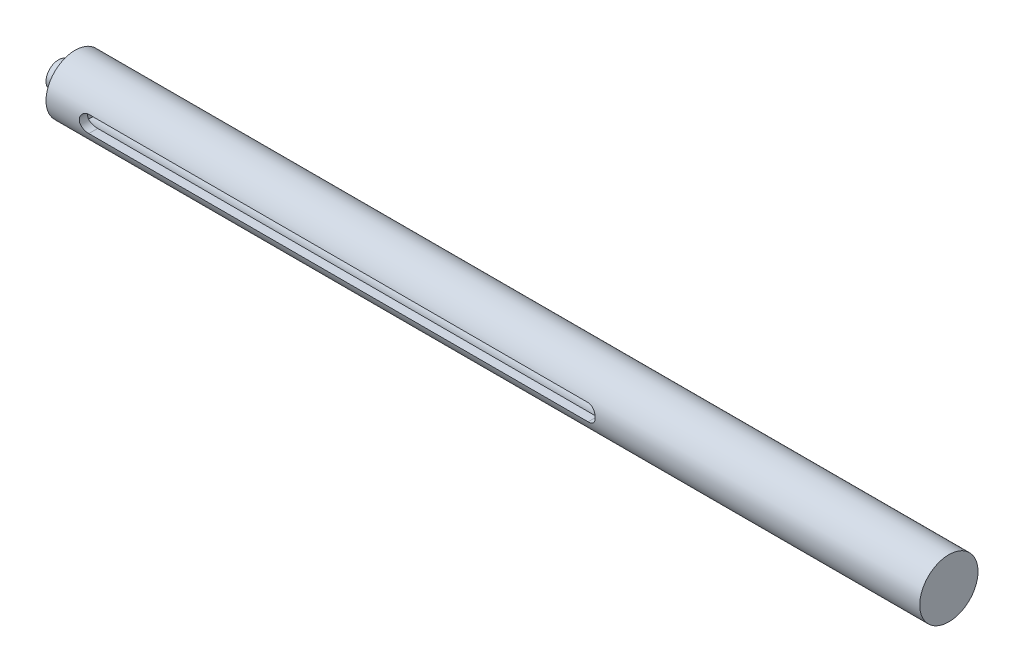
ISO-10303-21;
HEADER;
FILE_DESCRIPTION(('STEP AP214'),'2;1');
FILE_NAME('part.step','',(''),(''),'','','');
FILE_SCHEMA(('AUTOMOTIVE_DESIGN { 1 0 10303 214 1 1 1 1 }'));
ENDSEC;
DATA;
#1=APPLICATION_CONTEXT('core data for automotive mechanical design processes');
#2=APPLICATION_PROTOCOL_DEFINITION('international standard','automotive_design',2000,#1);
#3=PRODUCT_CONTEXT('',#1,'mechanical');
#4=PRODUCT('Part','Part','',(#3));
#5=PRODUCT_RELATED_PRODUCT_CATEGORY('part','',(#4));
#6=PRODUCT_DEFINITION_FORMATION('','',#4);
#7=PRODUCT_DEFINITION_CONTEXT('part definition',#1,'design');
#8=PRODUCT_DEFINITION('design','',#6,#7);
#9=PRODUCT_DEFINITION_SHAPE('','',#8);
#10=(LENGTH_UNIT() NAMED_UNIT(*) SI_UNIT(.MILLI.,.METRE.));
#11=(NAMED_UNIT(*) PLANE_ANGLE_UNIT() SI_UNIT($,.RADIAN.));
#12=(NAMED_UNIT(*) SI_UNIT($,.STERADIAN.) SOLID_ANGLE_UNIT());
#13=UNCERTAINTY_MEASURE_WITH_UNIT(LENGTH_MEASURE(1.E-05),#10,'distance_accuracy_value','');
#14=(GEOMETRIC_REPRESENTATION_CONTEXT(3) GLOBAL_UNCERTAINTY_ASSIGNED_CONTEXT((#13)) GLOBAL_UNIT_ASSIGNED_CONTEXT((#10,
#11,#12)) REPRESENTATION_CONTEXT('',''));
#15=CARTESIAN_POINT('',(0.,0.,0.));
#16=DIRECTION('',(0.,0.,1.));
#17=DIRECTION('',(1.,0.,0.));
#18=AXIS2_PLACEMENT_3D('',#15,#16,#17);
#19=CARTESIAN_POINT('',(-40.,0.,0.));
#20=DIRECTION('',(1.,0.,0.));
#21=DIRECTION('',(0.,0.,-1.));
#22=AXIS2_PLACEMENT_3D('',#19,#20,#21);
#23=PLANE('',#22);
#24=CARTESIAN_POINT('',(-40.,0.,0.));
#25=DIRECTION('',(1.,0.,0.));
#26=DIRECTION('',(0.,0.,-1.));
#27=AXIS2_PLACEMENT_3D('',#24,#25,#26);
#28=CIRCLE('',#27,3.5);
#29=CARTESIAN_POINT('',(-40.,0.,-3.5));
#30=VERTEX_POINT('',#29);
#31=EDGE_CURVE('E95',#30,#30,#28,.T.);
#32=ORIENTED_EDGE('',*,*,#31,.F.);
#33=EDGE_LOOP('',(#32));
#34=FACE_BOUND('',#33,.T.);
#35=CARTESIAN_POINT('',(-40.,0.,0.));
#36=DIRECTION('',(1.,0.,0.));
#37=DIRECTION('',(0.,0.,-1.));
#38=AXIS2_PLACEMENT_3D('',#35,#36,#37);
#39=CIRCLE('',#38,1.5);
#40=CARTESIAN_POINT('',(-40.,0.,-1.5));
#41=VERTEX_POINT('',#40);
#42=EDGE_CURVE('E35',#41,#41,#39,.F.);
#43=ORIENTED_EDGE('',*,*,#42,.F.);
#44=EDGE_LOOP('',(#43));
#45=FACE_BOUND('',#44,.T.);
#46=ADVANCED_FACE('F26',(#34,#45),#23,.F.);
#47=CARTESIAN_POINT('',(40.,0.,0.));
#48=DIRECTION('',(-1.,0.,0.));
#49=DIRECTION('',(0.,0.,1.));
#50=AXIS2_PLACEMENT_3D('',#47,#48,#49);
#51=CYLINDRICAL_SURFACE('',#50,3.5);
#52=ORIENTED_EDGE('',*,*,#31,.T.);
#53=EDGE_LOOP('',(#52));
#54=FACE_BOUND('',#53,.T.);
#55=CARTESIAN_POINT('',(25.,-1.,3.35410196624968));
#56=CARTESIAN_POINT('',(25.0275170249075,-1.00000049850503,3.35409976658492));
#57=CARTESIAN_POINT('',(25.0550202597348,-0.998863493287081,3.35444102034788));
#58=CARTESIAN_POINT('',(25.1098181033841,-0.994332009888001,3.35578786459359));
#59=CARTESIAN_POINT('',(25.1371127542802,-0.990937999820865,3.3567933173179));
#60=CARTESIAN_POINT('',(25.2182537496955,-0.977425314705552,3.36076375039943));
#61=CARTESIAN_POINT('',(25.2715378170372,-0.963975716618306,3.36468309657148));
#62=CARTESIAN_POINT('',(25.3749700144545,-0.928648815906224,3.37460265056326));
#63=CARTESIAN_POINT('',(25.4251189911293,-0.906773800005599,3.38060229373009));
#64=CARTESIAN_POINT('',(25.5210683200399,-0.855250482454159,3.39400252324997));
#65=CARTESIAN_POINT('',(25.5668668974157,-0.825599026596321,3.40140367773159));
#66=CARTESIAN_POINT('',(25.6540953815059,-0.758463189713919,3.41700871116802));
#67=CARTESIAN_POINT('',(25.6953820675198,-0.72079643428964,3.42522837538694));
#68=CARTESIAN_POINT('',(25.7711495263556,-0.639087782954267,3.44140944203543));
#69=CARTESIAN_POINT('',(25.8056291705064,-0.595044831905348,3.44937080145308));
#70=CARTESIAN_POINT('',(25.8674150706982,-0.500821950623903,3.46431682750159));
#71=CARTESIAN_POINT('',(25.8945760360545,-0.450543143150311,3.47128058280447));
#72=CARTESIAN_POINT('',(25.940001691248,-0.345901809951461,3.48326292773679));
#73=CARTESIAN_POINT('',(25.9582685086114,-0.291540264432993,3.48828198248995));
#74=CARTESIAN_POINT('',(25.9849170938375,-0.18177986422046,3.49569755735467));
#75=CARTESIAN_POINT('',(25.9935443291132,-0.126445076386653,3.49815908311015));
#76=CARTESIAN_POINT('',(26.0014433806286,-0.0150612429205636,3.50041048233729));
#77=CARTESIAN_POINT('',(26.0007167870587,0.0409876796872728,3.50020080992396));
#78=CARTESIAN_POINT('',(25.9900967865968,0.150490378802964,3.49718002611497));
#79=CARTESIAN_POINT('',(25.9804690968915,0.203972329131895,3.4944443251868));
#80=CARTESIAN_POINT('',(25.9527522573653,0.308526642102498,3.48676938053403));
#81=CARTESIAN_POINT('',(25.9346626803645,0.359598882951953,3.48183002556336));
#82=CARTESIAN_POINT('',(25.8903451327296,0.458537318553558,3.47019511125505));
#83=CARTESIAN_POINT('',(25.8640302352287,0.506362294335579,3.46348091788377));
#84=CARTESIAN_POINT('',(25.8040771088532,0.597004321590961,3.44901371958343));
#85=CARTESIAN_POINT('',(25.770437393581,0.639820353903323,3.44126050393247));
#86=CARTESIAN_POINT('',(25.695401201975,0.720812145758809,3.42522923719649));
#87=CARTESIAN_POINT('',(25.6537744565459,0.758773058684968,3.41694231453104));
#88=CARTESIAN_POINT('',(25.5646513518634,0.827240355260741,3.40101643089073));
#89=CARTESIAN_POINT('',(25.5171533336562,0.857744624720446,3.39337765408524));
#90=CARTESIAN_POINT('',(25.4171063869067,0.910632887034017,3.37957156162494));
#91=CARTESIAN_POINT('',(25.3645179481512,0.932945634858352,3.37341730876614));
#92=CARTESIAN_POINT('',(25.2561439679439,0.968311532076212,3.36343812734786));
#93=CARTESIAN_POINT('',(25.2003634116952,0.981378715751668,3.3596096696078));
#94=CARTESIAN_POINT('',(25.1200602690921,0.993060108315531,3.35616467475823));
#95=CARTESIAN_POINT('',(25.0961103225751,0.995662513879,3.35539270208153));
#96=CARTESIAN_POINT('',(25.0481108873562,0.999130770524189,3.35436137521794));
#97=CARTESIAN_POINT('',(25.0240616067922,0.999999270178643,3.35410123920007));
#98=CARTESIAN_POINT('',(25.,1.,3.35410196624968));
#99=B_SPLINE_CURVE_WITH_KNOTS('',3,(#55,#56,#57,#58,#59,#60,#61,#62,#63,#64,#65,#66,#67,#68,#69,
#70,#71,#72,#73,#74,#75,#76,#77,#78,#79,#80,#81,#82,#83,#84,#85,#86,#87,#88,#89,#90,#91,#92,#93,
#94,#95,#96,#97,#98),.UNSPECIFIED.,.F.,.F.,(4,2,2,2,2,2,2,2,2,2,2,2,2,2,2,2,2,2,2,2,2,4),(0.,
0.0824984357609059,0.164979766271595,0.329407523681618,0.493790685524924,0.658240626330376,
0.826933952896786,0.995655226942842,1.16751346138032,1.33933056621707,1.50666495361948,
1.67397089384628,1.83643825095359,1.99891381075498,2.16316806750177,2.32745568686297,
2.49749310251654,2.6675786732818,2.83911034045408,3.01038106966817,3.08263487199162,
3.15477822061624),.UNSPECIFIED.);
#100=CARTESIAN_POINT('',(25.,-1.,3.35410196624968));
#101=VERTEX_POINT('',#100);
#102=CARTESIAN_POINT('',(25.,1.,3.35410196624968));
#103=VERTEX_POINT('',#102);
#104=EDGE_CURVE('E98',#101,#103,#99,.T.);
#105=ORIENTED_EDGE('',*,*,#104,.F.);
#106=DIRECTION('',(-1.,0.,0.));
#107=VECTOR('',#106,1.);
#108=CARTESIAN_POINT('',(40.,-1.,3.35410196624968));
#109=LINE('',#108,#107);
#110=CARTESIAN_POINT('',(-35.,-1.,3.35410196624968));
#111=VERTEX_POINT('',#110);
#112=EDGE_CURVE('E160',#111,#101,#109,.F.);
#113=ORIENTED_EDGE('',*,*,#112,.F.);
#114=CARTESIAN_POINT('',(-35.,1.,3.35410196624968));
#115=CARTESIAN_POINT('',(-35.0275170249075,1.00000049850503,3.35409976658492));
#116=CARTESIAN_POINT('',(-35.0550202597348,0.998863493287082,3.35444102034788));
#117=CARTESIAN_POINT('',(-35.1098181033841,0.994332009888001,3.35578786459359));
#118=CARTESIAN_POINT('',(-35.1371127542802,0.990937999820865,3.3567933173179));
#119=CARTESIAN_POINT('',(-35.2182537496955,0.977425314705554,3.36076375039943));
#120=CARTESIAN_POINT('',(-35.2715378170372,0.963975716618308,3.36468309657148));
#121=CARTESIAN_POINT('',(-35.3749700144545,0.928648815906219,3.37460265056326));
#122=CARTESIAN_POINT('',(-35.4251189911293,0.906773800005585,3.38060229373009));
#123=CARTESIAN_POINT('',(-35.52106832004,0.855250482454147,3.39400252324997));
#124=CARTESIAN_POINT('',(-35.5668668974158,0.825599026596321,3.40140367773159));
#125=CARTESIAN_POINT('',(-35.6540953815059,0.75846318971392,3.41700871116802));
#126=CARTESIAN_POINT('',(-35.6953820675198,0.720796434289633,3.42522837538694));
#127=CARTESIAN_POINT('',(-35.7711495263556,0.639087782954258,3.44140944203543));
#128=CARTESIAN_POINT('',(-35.8056291705064,0.595044831905346,3.44937080145308));
#129=CARTESIAN_POINT('',(-35.8674150706982,0.500821950623907,3.46431682750159));
#130=CARTESIAN_POINT('',(-35.8945760360545,0.450543143150314,3.47128058280446));
#131=CARTESIAN_POINT('',(-35.940001691248,0.345901809951462,3.48326292773679));
#132=CARTESIAN_POINT('',(-35.9582685086114,0.291540264432993,3.48828198248995));
#133=CARTESIAN_POINT('',(-35.9849170938375,0.181779864220459,3.49569755735467));
#134=CARTESIAN_POINT('',(-35.9935443291132,0.126445076386652,3.49815908311015));
#135=CARTESIAN_POINT('',(-36.0014433806286,0.0150612429205627,3.50041048233729));
#136=CARTESIAN_POINT('',(-36.0007167870587,-0.0409876796872739,3.50020080992396));
#137=CARTESIAN_POINT('',(-35.9900967865968,-0.150490378802965,3.49718002611497));
#138=CARTESIAN_POINT('',(-35.9804690968915,-0.203972329131895,3.4944443251868));
#139=CARTESIAN_POINT('',(-35.9527522573653,-0.308526642102499,3.48676938053403));
#140=CARTESIAN_POINT('',(-35.9346626803645,-0.359598882951955,3.48183002556336));
#141=CARTESIAN_POINT('',(-35.8903451327296,-0.458537318553552,3.47019511125505));
#142=CARTESIAN_POINT('',(-35.8640302352286,-0.506362294335566,3.46348091788377));
#143=CARTESIAN_POINT('',(-35.8040771088533,-0.597004321590951,3.44901371958344));
#144=CARTESIAN_POINT('',(-35.7704373935811,-0.639820353903326,3.44126050393247));
#145=CARTESIAN_POINT('',(-35.695401201975,-0.720812145758812,3.42522923719649));
#146=CARTESIAN_POINT('',(-35.6537744565459,-0.758773058684957,3.41694231453104));
#147=CARTESIAN_POINT('',(-35.5646513518634,-0.827240355260727,3.40101643089074));
#148=CARTESIAN_POINT('',(-35.5171533336562,-0.857744624720442,3.39337765408524));
#149=CARTESIAN_POINT('',(-35.4171063869067,-0.910632887034021,3.37957156162494));
#150=CARTESIAN_POINT('',(-35.3645179481512,-0.932945634858353,3.37341730876614));
#151=CARTESIAN_POINT('',(-35.2561439679439,-0.968311532076213,3.36343812734786));
#152=CARTESIAN_POINT('',(-35.2003634116952,-0.981378715751669,3.3596096696078));
#153=CARTESIAN_POINT('',(-35.1200602690921,-0.993060108315532,3.35616467475823));
#154=CARTESIAN_POINT('',(-35.0961103225751,-0.995662513879001,3.35539270208153));
#155=CARTESIAN_POINT('',(-35.0481108873562,-0.999130770524188,3.35436137521794));
#156=CARTESIAN_POINT('',(-35.0240616067922,-0.999999270178643,3.35410123920007));
#157=CARTESIAN_POINT('',(-35.,-1.,3.35410196624968));
#158=B_SPLINE_CURVE_WITH_KNOTS('',3,(#114,#115,#116,#117,#118,#119,#120,#121,#122,#123,#124,
#125,#126,#127,#128,#129,#130,#131,#132,#133,#134,#135,#136,#137,#138,#139,#140,#141,#142,#143,
#144,#145,#146,#147,#148,#149,#150,#151,#152,#153,#154,#155,#156,#157),.UNSPECIFIED.,.F.,.F.,(4,
2,2,2,2,2,2,2,2,2,2,2,2,2,2,2,2,2,2,2,2,4),(0.,0.0824984357609093,0.164979766271588,
0.329407523681618,0.493790685524952,0.658240626330415,0.826933952896799,0.99565522694284,
1.16751346138032,1.33933056621707,1.50666495361948,1.67397089384628,1.8364382509536,
1.99891381075499,2.16316806750176,2.32745568686294,2.49749310251653,2.66757867328181,
2.83911034045409,3.01038106966818,3.08263487199164,3.15477822061625),.UNSPECIFIED.);
#159=CARTESIAN_POINT('',(-35.,1.,3.35410196624968));
#160=VERTEX_POINT('',#159);
#161=EDGE_CURVE('E105',#160,#111,#158,.T.);
#162=ORIENTED_EDGE('',*,*,#161,.F.);
#163=DIRECTION('',(-1.,0.,0.));
#164=VECTOR('',#163,1.);
#165=CARTESIAN_POINT('',(40.,1.,3.35410196624968));
#166=LINE('',#165,#164);
#167=EDGE_CURVE('E83',#103,#160,#166,.T.);
#168=ORIENTED_EDGE('',*,*,#167,.F.);
#169=EDGE_LOOP('',(#105,#113,#162,#168));
#170=FACE_BOUND('',#169,.T.);
#171=CARTESIAN_POINT('',(65.,0.,0.));
#172=DIRECTION('',(1.,0.,0.));
#173=DIRECTION('',(0.,0.,-1.));
#174=AXIS2_PLACEMENT_3D('',#171,#172,#173);
#175=CIRCLE('',#174,3.5);
#176=CARTESIAN_POINT('',(65.,0.,-3.5));
#177=VERTEX_POINT('',#176);
#178=EDGE_CURVE('E78',#177,#177,#175,.T.);
#179=ORIENTED_EDGE('',*,*,#178,.F.);
#180=EDGE_LOOP('',(#179));
#181=FACE_BOUND('',#180,.T.);
#182=ADVANCED_FACE('F28',(#54,#170,#181),#51,.T.);
#183=CARTESIAN_POINT('',(-35.,0.,3.5));
#184=DIRECTION('',(0.,0.,-1.));
#185=DIRECTION('',(-1.,0.,0.));
#186=AXIS2_PLACEMENT_3D('',#183,#184,#185);
#187=CYLINDRICAL_SURFACE('',#186,1.);
#188=CARTESIAN_POINT('',(-35.,1.,2.29128784747792));
#189=CARTESIAN_POINT('',(-35.0269103840027,1.00000116386643,2.29128430939571));
#190=CARTESIAN_POINT('',(-35.0538065609444,0.998913043941582,2.29176252371932));
#191=CARTESIAN_POINT('',(-35.1073819223814,0.994580942217761,2.29364713413326));
#192=CARTESIAN_POINT('',(-35.1340611856053,0.991337781507211,2.29505317671192));
#193=CARTESIAN_POINT('',(-35.2132675610055,0.978449878798021,2.30059288924686));
#194=CARTESIAN_POINT('',(-35.2652248346111,0.965646201662909,2.30604882507105));
#195=CARTESIAN_POINT('',(-35.3660084567948,0.932127367996509,2.31979763689074));
#196=CARTESIAN_POINT('',(-35.4148379987117,0.91142043585267,2.32808756281048));
#197=CARTESIAN_POINT('',(-35.5083868962999,0.862742971325663,2.34656153650137));
#198=CARTESIAN_POINT('',(-35.5531022895601,0.834765533722777,2.35674738231355));
#199=CARTESIAN_POINT('',(-35.639634338551,0.770658598314694,2.37850508848236));
#200=CARTESIAN_POINT('',(-35.6811844510361,0.734184414240038,2.39012125272111));
#201=CARTESIAN_POINT('',(-35.7577692933566,0.654848386636597,2.41306392819471));
#202=CARTESIAN_POINT('',(-35.792802685594,0.611985234976875,2.42439037955359));
#203=CARTESIAN_POINT('',(-35.856703436018,0.519002909887977,2.44601709248996));
#204=CARTESIAN_POINT('',(-35.8852724685305,0.468663954715679,2.45625912457899));
#205=CARTESIAN_POINT('',(-35.9334219724715,0.363412083428239,2.47401971876446));
#206=CARTESIAN_POINT('',(-35.9530061953086,0.30850108760279,2.48153941723396));
#207=CARTESIAN_POINT('',(-35.9816706165632,0.19848371770778,2.49269157373246));
#208=CARTESIAN_POINT('',(-35.9912134797064,0.143515526475389,2.49649461286354));
#209=CARTESIAN_POINT('',(-36.0010142357207,0.0326342160141269,2.50040155088157));
#210=CARTESIAN_POINT('',(-36.001275417903,-0.0232785614371597,2.50050676023285));
#211=CARTESIAN_POINT('',(-35.9927585814665,-0.1311166883068,2.49710980025699));
#212=CARTESIAN_POINT('',(-35.9844874769435,-0.183089601305246,2.49380992793548));
#213=CARTESIAN_POINT('',(-35.9600032861927,-0.284837393198609,2.48424635219906));
#214=CARTESIAN_POINT('',(-35.94378975049,-0.334612147522428,2.47798248104744));
#215=CARTESIAN_POINT('',(-35.9036818518646,-0.431448769549348,2.46298415299617));
#216=CARTESIAN_POINT('',(-35.8796753796154,-0.478458425687026,2.45421387377984));
#217=CARTESIAN_POINT('',(-35.8247677056818,-0.567903734595059,2.43507301003961));
#218=CARTESIAN_POINT('',(-35.793864085149,-0.610337774922437,2.42470186448207));
#219=CARTESIAN_POINT('',(-35.7236779098768,-0.692381696369259,2.40260891373089));
#220=CARTESIAN_POINT('',(-35.6839787626666,-0.731623851544995,2.39084313586447));
#221=CARTESIAN_POINT('',(-35.5985099524245,-0.803049630497082,2.3678097529232));
#222=CARTESIAN_POINT('',(-35.5527375389524,-0.835230038544943,2.3565423766639));
#223=CARTESIAN_POINT('',(-35.4547648579898,-0.89246828966811,2.33547844428013));
#224=CARTESIAN_POINT('',(-35.40241758167,-0.917294661088132,2.32573351075292));
#225=CARTESIAN_POINT('',(-35.2938192377852,-0.957606491786299,2.30943052529791));
#226=CARTESIAN_POINT('',(-35.2375752763308,-0.973108480011036,2.30286683814369));
#227=CARTESIAN_POINT('',(-35.150628182921,-0.989052909128603,2.29604151764747));
#228=CARTESIAN_POINT('',(-35.1206712253493,-0.993152525829897,2.29426718840263));
#229=CARTESIAN_POINT('',(-35.0604824905022,-0.998626410519056,2.29188770157194));
#230=CARTESIAN_POINT('',(-35.0302508941211,-1.00000235784284,2.29128182355872));
#231=CARTESIAN_POINT('',(-35.,-1.,2.29128784747792));
#232=B_SPLINE_CURVE_WITH_KNOTS('',3,(#188,#189,#190,#191,#192,#193,#194,#195,#196,#197,#198,
#199,#200,#201,#202,#203,#204,#205,#206,#207,#208,#209,#210,#211,#212,#213,#214,#215,#216,#217,
#218,#219,#220,#221,#222,#223,#224,#225,#226,#227,#228,#229,#230,#231),.UNSPECIFIED.,.F.,.F.,(4,
2,2,2,2,2,2,2,2,2,2,2,2,2,2,2,2,2,2,2,2,4),(0.,0.0806774265494227,0.161324131941622,
0.32184353760246,0.482196354925837,0.64270202876941,0.811445094033768,0.98022275675223,
1.15566914868509,1.33104222004289,1.49792423657763,1.66474711162956,1.82219943035396,
1.97966066058455,2.13949573869401,2.29938695972136,2.46976422743204,2.64021892007596,
2.81557606179859,2.99062143201691,3.08135581684535,3.17203424002409),.UNSPECIFIED.);
#233=CARTESIAN_POINT('',(-35.,1.,2.29128784747792));
#234=VERTEX_POINT('',#233);
#235=CARTESIAN_POINT('',(-35.,-1.,2.29128784747792));
#236=VERTEX_POINT('',#235);
#237=EDGE_CURVE('E68',#234,#236,#232,.T.);
#238=ORIENTED_EDGE('',*,*,#237,.F.);
#239=DIRECTION('',(0.,0.,-1.));
#240=VECTOR('',#239,1.);
#241=CARTESIAN_POINT('',(-35.,1.,3.5));
#242=LINE('',#241,#240);
#243=EDGE_CURVE('E75',#160,#234,#242,.T.);
#244=ORIENTED_EDGE('',*,*,#243,.F.);
#245=ORIENTED_EDGE('',*,*,#161,.T.);
#246=DIRECTION('',(0.,0.,-1.));
#247=VECTOR('',#246,1.);
#248=CARTESIAN_POINT('',(-35.,-1.,3.5));
#249=LINE('',#248,#247);
#250=EDGE_CURVE('E77',#111,#236,#249,.T.);
#251=ORIENTED_EDGE('',*,*,#250,.T.);
#252=EDGE_LOOP('',(#238,#244,#245,#251));
#253=FACE_BOUND('',#252,.T.);
#254=ADVANCED_FACE('F74',(#253),#187,.F.);
#255=CARTESIAN_POINT('',(-35.,-1.,3.5));
#256=DIRECTION('',(0.,1.,0.));
#257=DIRECTION('',(-1.,0.,0.));
#258=AXIS2_PLACEMENT_3D('',#255,#256,#257);
#259=PLANE('',#258);
#260=DIRECTION('',(1.,0.,0.));
#261=VECTOR('',#260,1.);
#262=CARTESIAN_POINT('',(-47.0710678118655,-1.,2.29128784747792));
#263=LINE('',#262,#261);
#264=CARTESIAN_POINT('',(25.,-1.,2.29128784747792));
#265=VERTEX_POINT('',#264);
#266=EDGE_CURVE('E79',#236,#265,#263,.T.);
#267=ORIENTED_EDGE('',*,*,#266,.F.);
#268=ORIENTED_EDGE('',*,*,#250,.F.);
#269=ORIENTED_EDGE('',*,*,#112,.T.);
#270=DIRECTION('',(0.,0.,-1.));
#271=VECTOR('',#270,1.);
#272=CARTESIAN_POINT('',(25.,-1.,3.5));
#273=LINE('',#272,#271);
#274=EDGE_CURVE('E86',#101,#265,#273,.T.);
#275=ORIENTED_EDGE('',*,*,#274,.T.);
#276=EDGE_LOOP('',(#267,#268,#269,#275));
#277=FACE_BOUND('',#276,.T.);
#278=ADVANCED_FACE('F117',(#277),#259,.T.);
#279=CARTESIAN_POINT('',(25.,0.,3.5));
#280=DIRECTION('',(0.,0.,-1.));
#281=DIRECTION('',(-1.,0.,0.));
#282=AXIS2_PLACEMENT_3D('',#279,#280,#281);
#283=CYLINDRICAL_SURFACE('',#282,1.);
#284=CARTESIAN_POINT('',(25.,-1.,2.29128784747792));
#285=CARTESIAN_POINT('',(25.0269103840027,-1.00000116386643,2.29128430939571));
#286=CARTESIAN_POINT('',(25.0538065609444,-0.998913043941582,2.29176252371932));
#287=CARTESIAN_POINT('',(25.1073819223814,-0.994580942217764,2.29364713413326));
#288=CARTESIAN_POINT('',(25.1340611856052,-0.991337781507216,2.29505317671192));
#289=CARTESIAN_POINT('',(25.2132675610054,-0.978449878798026,2.30059288924686));
#290=CARTESIAN_POINT('',(25.2652248346111,-0.965646201662906,2.30604882507105));
#291=CARTESIAN_POINT('',(25.3660084567947,-0.932127367996508,2.31979763689074));
#292=CARTESIAN_POINT('',(25.4148379987117,-0.911420435852677,2.32808756281048));
#293=CARTESIAN_POINT('',(25.5083868962999,-0.862742971325673,2.34656153650137));
#294=CARTESIAN_POINT('',(25.5531022895601,-0.834765533722784,2.35674738231355));
#295=CARTESIAN_POINT('',(25.639634338551,-0.770658598314696,2.37850508848236));
#296=CARTESIAN_POINT('',(25.6811844510361,-0.73418441424004,2.39012125272111));
#297=CARTESIAN_POINT('',(25.7577692933566,-0.654848386636598,2.41306392819471));
#298=CARTESIAN_POINT('',(25.792802685594,-0.611985234976875,2.42439037955359));
#299=CARTESIAN_POINT('',(25.856703436018,-0.519002909887977,2.44601709248996));
#300=CARTESIAN_POINT('',(25.8852724685305,-0.468663954715677,2.45625912457899));
#301=CARTESIAN_POINT('',(25.9334219724715,-0.363412083428237,2.47401971876446));
#302=CARTESIAN_POINT('',(25.9530061953086,-0.308501087602788,2.48153941723396));
#303=CARTESIAN_POINT('',(25.9816706165632,-0.198483717707779,2.49269157373246));
#304=CARTESIAN_POINT('',(25.9912134797064,-0.143515526475389,2.49649461286354));
#305=CARTESIAN_POINT('',(26.0010142357207,-0.0326342160141267,2.50040155088157));
#306=CARTESIAN_POINT('',(26.001275417903,0.0232785614371597,2.50050676023285));
#307=CARTESIAN_POINT('',(25.9927585814666,0.1311166883068,2.49710980025699));
#308=CARTESIAN_POINT('',(25.9844874769436,0.183089601305246,2.49380992793548));
#309=CARTESIAN_POINT('',(25.9600032861927,0.284837393198608,2.48424635219906));
#310=CARTESIAN_POINT('',(25.94378975049,0.334612147522426,2.47798248104744));
#311=CARTESIAN_POINT('',(25.9036818518646,0.431448769549353,2.46298415299616));
#312=CARTESIAN_POINT('',(25.8796753796154,0.478458425687039,2.45421387377984));
#313=CARTESIAN_POINT('',(25.8247677056818,0.567903734595067,2.43507301003961));
#314=CARTESIAN_POINT('',(25.793864085149,0.610337774922431,2.42470186448208));
#315=CARTESIAN_POINT('',(25.7236779098768,0.692381696369253,2.40260891373089));
#316=CARTESIAN_POINT('',(25.6839787626666,0.731623851545005,2.39084313586447));
#317=CARTESIAN_POINT('',(25.5985099524245,0.803049630497096,2.3678097529232));
#318=CARTESIAN_POINT('',(25.5527375389524,0.835230038544947,2.3565423766639));
#319=CARTESIAN_POINT('',(25.4547648579898,0.892468289668106,2.33547844428014));
#320=CARTESIAN_POINT('',(25.40241758167,0.917294661088129,2.32573351075292));
#321=CARTESIAN_POINT('',(25.2938192377852,0.957606491786299,2.30943052529791));
#322=CARTESIAN_POINT('',(25.2375752763308,0.973108480011036,2.30286683814369));
#323=CARTESIAN_POINT('',(25.150628182921,0.989052909128603,2.29604151764747));
#324=CARTESIAN_POINT('',(25.1206712253493,0.993152525829897,2.29426718840263));
#325=CARTESIAN_POINT('',(25.0604824905022,0.998626410519057,2.29188770157194));
#326=CARTESIAN_POINT('',(25.0302508941211,1.00000235784284,2.29128182355872));
#327=CARTESIAN_POINT('',(25.,1.,2.29128784747792));
#328=B_SPLINE_CURVE_WITH_KNOTS('',3,(#284,#285,#286,#287,#288,#289,#290,#291,#292,#293,#294,
#295,#296,#297,#298,#299,#300,#301,#302,#303,#304,#305,#306,#307,#308,#309,#310,#311,#312,#313,
#314,#315,#316,#317,#318,#319,#320,#321,#322,#323,#324,#325,#326,#327),.UNSPECIFIED.,.F.,.F.,(4,
2,2,2,2,2,2,2,2,2,2,2,2,2,2,2,2,2,2,2,2,4),(0.,0.0806774265494018,0.161324131941586,
0.321843537602416,0.482196354925818,0.642702028769406,0.811445094033764,0.980222756752228,
1.1556691486851,1.33104222004289,1.49792423657763,1.66474711162956,1.82219943035396,
1.97966066058455,2.13949573869402,2.29938695972139,2.46976422743206,2.64021892007595,
2.81557606179858,2.9906214320169,3.08135581684534,3.17203424002408),.UNSPECIFIED.);
#329=CARTESIAN_POINT('',(25.,1.,2.29128784747792));
#330=VERTEX_POINT('',#329);
#331=EDGE_CURVE('E41',#265,#330,#328,.T.);
#332=ORIENTED_EDGE('',*,*,#331,.F.);
#333=ORIENTED_EDGE('',*,*,#274,.F.);
#334=ORIENTED_EDGE('',*,*,#104,.T.);
#335=DIRECTION('',(0.,0.,-1.));
#336=VECTOR('',#335,1.);
#337=CARTESIAN_POINT('',(25.,1.,3.5));
#338=LINE('',#337,#336);
#339=EDGE_CURVE('E48',#103,#330,#338,.T.);
#340=ORIENTED_EDGE('',*,*,#339,.T.);
#341=EDGE_LOOP('',(#332,#333,#334,#340));
#342=FACE_BOUND('',#341,.T.);
#343=ADVANCED_FACE('F112',(#342),#283,.F.);
#344=CARTESIAN_POINT('',(-35.,1.,3.5));
#345=DIRECTION('',(0.,-1.,0.));
#346=DIRECTION('',(0.,0.,-1.));
#347=AXIS2_PLACEMENT_3D('',#344,#345,#346);
#348=PLANE('',#347);
#349=DIRECTION('',(1.,0.,0.));
#350=VECTOR('',#349,1.);
#351=CARTESIAN_POINT('',(-47.0710678118655,1.,2.29128784747792));
#352=LINE('',#351,#350);
#353=EDGE_CURVE('E14',#330,#234,#352,.F.);
#354=ORIENTED_EDGE('',*,*,#353,.F.);
#355=ORIENTED_EDGE('',*,*,#339,.F.);
#356=ORIENTED_EDGE('',*,*,#167,.T.);
#357=ORIENTED_EDGE('',*,*,#243,.T.);
#358=EDGE_LOOP('',(#354,#355,#356,#357));
#359=FACE_BOUND('',#358,.T.);
#360=ADVANCED_FACE('F81',(#359),#348,.T.);
#361=CARTESIAN_POINT('',(-42.,0.,0.));
#362=DIRECTION('',(1.,0.,0.));
#363=DIRECTION('',(0.,0.,-1.));
#364=AXIS2_PLACEMENT_3D('',#361,#362,#363);
#365=CYLINDRICAL_SURFACE('',#364,1.5);
#366=CARTESIAN_POINT('',(-42.,0.,0.));
#367=DIRECTION('',(-1.,0.,0.));
#368=DIRECTION('',(0.,0.,1.));
#369=AXIS2_PLACEMENT_3D('',#366,#367,#368);
#370=CIRCLE('',#369,1.5);
#371=CARTESIAN_POINT('',(-42.,0.,1.5));
#372=VERTEX_POINT('',#371);
#373=EDGE_CURVE('E84',#372,#372,#370,.T.);
#374=ORIENTED_EDGE('',*,*,#373,.F.);
#375=EDGE_LOOP('',(#374));
#376=FACE_BOUND('',#375,.T.);
#377=ORIENTED_EDGE('',*,*,#42,.T.);
#378=EDGE_LOOP('',(#377));
#379=FACE_BOUND('',#378,.T.);
#380=ADVANCED_FACE('F177',(#376,#379),#365,.T.);
#381=CARTESIAN_POINT('',(-42.,0.,0.));
#382=DIRECTION('',(-1.,0.,0.));
#383=DIRECTION('',(0.,0.,1.));
#384=AXIS2_PLACEMENT_3D('',#381,#382,#383);
#385=PLANE('',#384);
#386=ORIENTED_EDGE('',*,*,#373,.T.);
#387=EDGE_LOOP('',(#386));
#388=FACE_BOUND('',#387,.T.);
#389=ADVANCED_FACE('F172',(#388),#385,.T.);
#390=CARTESIAN_POINT('',(65.,0.,0.));
#391=DIRECTION('',(1.,0.,0.));
#392=DIRECTION('',(0.,0.,-1.));
#393=AXIS2_PLACEMENT_3D('',#390,#391,#392);
#394=PLANE('',#393);
#395=ORIENTED_EDGE('',*,*,#178,.T.);
#396=EDGE_LOOP('',(#395));
#397=FACE_BOUND('',#396,.T.);
#398=ADVANCED_FACE('F136',(#397),#394,.T.);
#399=CARTESIAN_POINT('',(-47.0710678118655,0.,0.));
#400=DIRECTION('',(1.,0.,0.));
#401=DIRECTION('',(0.,0.,-1.));
#402=AXIS2_PLACEMENT_3D('',#399,#400,#401);
#403=CYLINDRICAL_SURFACE('',#402,2.5);
#404=ORIENTED_EDGE('',*,*,#237,.T.);
#405=ORIENTED_EDGE('',*,*,#266,.T.);
#406=ORIENTED_EDGE('',*,*,#331,.T.);
#407=ORIENTED_EDGE('',*,*,#353,.T.);
#408=EDGE_LOOP('',(#404,#405,#406,#407));
#409=FACE_BOUND('',#408,.T.);
#410=CARTESIAN_POINT('',(-38.,0.,0.));
#411=DIRECTION('',(1.,0.,0.));
#412=DIRECTION('',(0.,0.,-1.));
#413=AXIS2_PLACEMENT_3D('',#410,#411,#412);
#414=CIRCLE('',#413,2.5);
#415=CARTESIAN_POINT('',(-38.,0.,-2.5));
#416=VERTEX_POINT('',#415);
#417=EDGE_CURVE('E129',#416,#416,#414,.F.);
#418=ORIENTED_EDGE('',*,*,#417,.T.);
#419=EDGE_LOOP('',(#418));
#420=FACE_BOUND('',#419,.T.);
#421=CARTESIAN_POINT('',(63.,0.,0.));
#422=DIRECTION('',(1.,0.,0.));
#423=DIRECTION('',(0.,0.,-1.));
#424=AXIS2_PLACEMENT_3D('',#421,#422,#423);
#425=CIRCLE('',#424,2.5);
#426=CARTESIAN_POINT('',(63.,0.,-2.5));
#427=VERTEX_POINT('',#426);
#428=EDGE_CURVE('E263',#427,#427,#425,.T.);
#429=ORIENTED_EDGE('',*,*,#428,.T.);
#430=EDGE_LOOP('',(#429));
#431=FACE_BOUND('',#430,.T.);
#432=ADVANCED_FACE('F66',(#409,#420,#431),#403,.F.);
#433=CARTESIAN_POINT('',(-38.,0.,0.));
#434=DIRECTION('',(1.,0.,0.));
#435=DIRECTION('',(0.,0.,-1.));
#436=AXIS2_PLACEMENT_3D('',#433,#434,#435);
#437=PLANE('',#436);
#438=ORIENTED_EDGE('',*,*,#417,.F.);
#439=EDGE_LOOP('',(#438));
#440=FACE_BOUND('',#439,.T.);
#441=ADVANCED_FACE('F135',(#440),#437,.T.);
#442=CARTESIAN_POINT('',(63.,0.,0.));
#443=DIRECTION('',(1.,0.,0.));
#444=DIRECTION('',(0.,0.,-1.));
#445=AXIS2_PLACEMENT_3D('',#442,#443,#444);
#446=PLANE('',#445);
#447=ORIENTED_EDGE('',*,*,#428,.F.);
#448=EDGE_LOOP('',(#447));
#449=FACE_BOUND('',#448,.T.);
#450=ADVANCED_FACE('F247',(#449),#446,.F.);
#451=CLOSED_SHELL('',(#46,#182,#254,#278,#343,#360,#380,#389,#398,#432,#441,#450));
#452=MANIFOLD_SOLID_BREP('B1',#451);
#453=ADVANCED_BREP_SHAPE_REPRESENTATION('',(#18,#452),#14);
#454=SHAPE_DEFINITION_REPRESENTATION(#9,#453);
ENDSEC;
END-ISO-10303-21;
